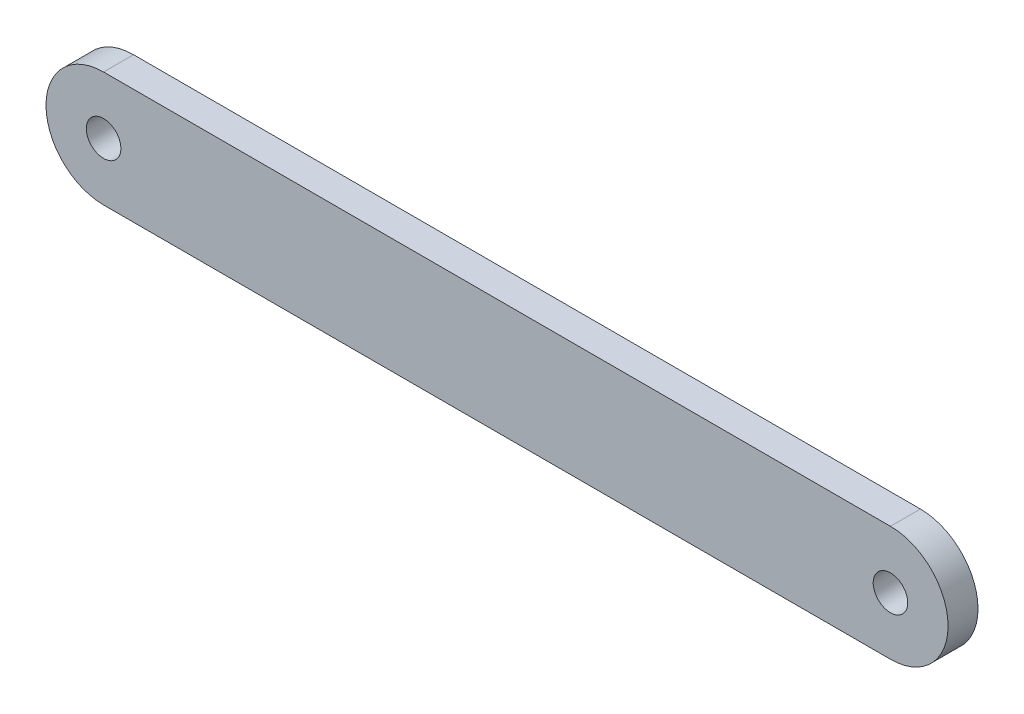
ISO-10303-21;
HEADER;
FILE_DESCRIPTION(('STEP AP214'),'2;1');
FILE_NAME('part.step','',(''),(''),'','','');
FILE_SCHEMA(('AUTOMOTIVE_DESIGN { 1 0 10303 214 1 1 1 1 }'));
ENDSEC;
DATA;
#1=APPLICATION_CONTEXT('core data for automotive mechanical design processes');
#2=APPLICATION_PROTOCOL_DEFINITION('international standard','automotive_design',2000,#1);
#3=PRODUCT_CONTEXT('',#1,'mechanical');
#4=PRODUCT('Part','Part','',(#3));
#5=PRODUCT_RELATED_PRODUCT_CATEGORY('part','',(#4));
#6=PRODUCT_DEFINITION_FORMATION('','',#4);
#7=PRODUCT_DEFINITION_CONTEXT('part definition',#1,'design');
#8=PRODUCT_DEFINITION('design','',#6,#7);
#9=PRODUCT_DEFINITION_SHAPE('','',#8);
#10=(LENGTH_UNIT() NAMED_UNIT(*) SI_UNIT(.MILLI.,.METRE.));
#11=(NAMED_UNIT(*) PLANE_ANGLE_UNIT() SI_UNIT($,.RADIAN.));
#12=(NAMED_UNIT(*) SI_UNIT($,.STERADIAN.) SOLID_ANGLE_UNIT());
#13=UNCERTAINTY_MEASURE_WITH_UNIT(LENGTH_MEASURE(1.E-05),#10,'distance_accuracy_value','');
#14=(GEOMETRIC_REPRESENTATION_CONTEXT(3) GLOBAL_UNCERTAINTY_ASSIGNED_CONTEXT((#13)) GLOBAL_UNIT_ASSIGNED_CONTEXT((#10,
#11,#12)) REPRESENTATION_CONTEXT('',''));
#15=CARTESIAN_POINT('',(0.,0.,0.));
#16=DIRECTION('',(0.,0.,1.));
#17=DIRECTION('',(1.,0.,0.));
#18=AXIS2_PLACEMENT_3D('',#15,#16,#17);
#19=CARTESIAN_POINT('',(-17.08,0.,0.65));
#20=DIRECTION('',(0.,0.,1.));
#21=DIRECTION('',(1.,0.,0.));
#22=AXIS2_PLACEMENT_3D('',#19,#20,#21);
#23=PLANE('',#22);
#24=CARTESIAN_POINT('',(-17.08,0.,0.65));
#25=DIRECTION('',(0.,0.,1.));
#26=DIRECTION('',(1.,0.,0.));
#27=AXIS2_PLACEMENT_3D('',#24,#25,#26);
#28=CIRCLE('',#27,0.750000000000002);
#29=CARTESIAN_POINT('',(-16.33,0.,0.65));
#30=VERTEX_POINT('',#29);
#31=EDGE_CURVE('E100',#30,#30,#28,.T.);
#32=ORIENTED_EDGE('',*,*,#31,.F.);
#33=EDGE_LOOP('',(#32));
#34=FACE_BOUND('',#33,.T.);
#35=CARTESIAN_POINT('',(-17.08,0.,0.65));
#36=DIRECTION('',(0.,0.,1.));
#37=DIRECTION('',(1.,0.,0.));
#38=AXIS2_PLACEMENT_3D('',#35,#36,#37);
#39=CIRCLE('',#38,2.50000000000001);
#40=CARTESIAN_POINT('',(-17.08,2.50000000000001,0.65));
#41=VERTEX_POINT('',#40);
#42=CARTESIAN_POINT('',(-17.08,-2.50000000000001,0.65));
#43=VERTEX_POINT('',#42);
#44=EDGE_CURVE('E85',#41,#43,#39,.T.);
#45=ORIENTED_EDGE('',*,*,#44,.T.);
#46=DIRECTION('',(1.,0.,0.));
#47=VECTOR('',#46,1.);
#48=CARTESIAN_POINT('',(-17.08,-2.50000000000001,0.65));
#49=LINE('',#48,#47);
#50=CARTESIAN_POINT('',(17.08,-2.5,0.65));
#51=VERTEX_POINT('',#50);
#52=EDGE_CURVE('E80',#43,#51,#49,.T.);
#53=ORIENTED_EDGE('',*,*,#52,.T.);
#54=CARTESIAN_POINT('',(17.08,0.,0.65));
#55=DIRECTION('',(0.,0.,1.));
#56=DIRECTION('',(1.,0.,0.));
#57=AXIS2_PLACEMENT_3D('',#54,#55,#56);
#58=CIRCLE('',#57,2.50000000000001);
#59=CARTESIAN_POINT('',(17.08,2.50000000000001,0.65));
#60=VERTEX_POINT('',#59);
#61=EDGE_CURVE('E83',#51,#60,#58,.T.);
#62=ORIENTED_EDGE('',*,*,#61,.T.);
#63=DIRECTION('',(-1.,0.,0.));
#64=VECTOR('',#63,1.);
#65=CARTESIAN_POINT('',(-17.08,2.50000000000001,0.65));
#66=LINE('',#65,#64);
#67=EDGE_CURVE('E50',#60,#41,#66,.T.);
#68=ORIENTED_EDGE('',*,*,#67,.T.);
#69=EDGE_LOOP('',(#45,#53,#62,#68));
#70=FACE_BOUND('',#69,.T.);
#71=CARTESIAN_POINT('',(17.08,0.,0.65));
#72=DIRECTION('',(0.,0.,1.));
#73=DIRECTION('',(1.,0.,0.));
#74=AXIS2_PLACEMENT_3D('',#71,#72,#73);
#75=CIRCLE('',#74,0.750000000000002);
#76=CARTESIAN_POINT('',(17.83,0.,0.65));
#77=VERTEX_POINT('',#76);
#78=EDGE_CURVE('E115',#77,#77,#75,.T.);
#79=ORIENTED_EDGE('',*,*,#78,.F.);
#80=EDGE_LOOP('',(#79));
#81=FACE_BOUND('',#80,.T.);
#82=ADVANCED_FACE('F33',(#34,#70,#81),#23,.T.);
#83=CARTESIAN_POINT('',(-17.08,0.,-0.65));
#84=DIRECTION('',(0.,0.,1.));
#85=DIRECTION('',(1.,0.,0.));
#86=AXIS2_PLACEMENT_3D('',#83,#84,#85);
#87=PLANE('',#86);
#88=CARTESIAN_POINT('',(-17.08,0.,-0.65));
#89=DIRECTION('',(0.,0.,1.));
#90=DIRECTION('',(1.,0.,0.));
#91=AXIS2_PLACEMENT_3D('',#88,#89,#90);
#92=CIRCLE('',#91,2.50000000000001);
#93=CARTESIAN_POINT('',(-17.08,2.50000000000001,-0.65));
#94=VERTEX_POINT('',#93);
#95=CARTESIAN_POINT('',(-17.08,-2.50000000000001,-0.65));
#96=VERTEX_POINT('',#95);
#97=EDGE_CURVE('E97',#94,#96,#92,.T.);
#98=ORIENTED_EDGE('',*,*,#97,.F.);
#99=DIRECTION('',(-1.,0.,0.));
#100=VECTOR('',#99,1.);
#101=CARTESIAN_POINT('',(-17.08,2.50000000000001,-0.65));
#102=LINE('',#101,#100);
#103=CARTESIAN_POINT('',(17.08,2.50000000000001,-0.65));
#104=VERTEX_POINT('',#103);
#105=EDGE_CURVE('E73',#104,#94,#102,.T.);
#106=ORIENTED_EDGE('',*,*,#105,.F.);
#107=CARTESIAN_POINT('',(17.08,0.,-0.65));
#108=DIRECTION('',(0.,0.,1.));
#109=DIRECTION('',(1.,0.,0.));
#110=AXIS2_PLACEMENT_3D('',#107,#108,#109);
#111=CIRCLE('',#110,2.50000000000001);
#112=CARTESIAN_POINT('',(17.08,-2.5,-0.65));
#113=VERTEX_POINT('',#112);
#114=EDGE_CURVE('E67',#113,#104,#111,.T.);
#115=ORIENTED_EDGE('',*,*,#114,.F.);
#116=DIRECTION('',(1.,0.,0.));
#117=VECTOR('',#116,1.);
#118=CARTESIAN_POINT('',(-17.08,-2.50000000000001,-0.65));
#119=LINE('',#118,#117);
#120=EDGE_CURVE('E89',#96,#113,#119,.T.);
#121=ORIENTED_EDGE('',*,*,#120,.F.);
#122=EDGE_LOOP('',(#98,#106,#115,#121));
#123=FACE_BOUND('',#122,.T.);
#124=CARTESIAN_POINT('',(-17.08,0.,-0.65));
#125=DIRECTION('',(0.,0.,1.));
#126=DIRECTION('',(1.,0.,0.));
#127=AXIS2_PLACEMENT_3D('',#124,#125,#126);
#128=CIRCLE('',#127,0.750000000000002);
#129=CARTESIAN_POINT('',(-16.33,0.,-0.65));
#130=VERTEX_POINT('',#129);
#131=EDGE_CURVE('E112',#130,#130,#128,.T.);
#132=ORIENTED_EDGE('',*,*,#131,.T.);
#133=EDGE_LOOP('',(#132));
#134=FACE_BOUND('',#133,.T.);
#135=CARTESIAN_POINT('',(17.08,0.,-0.65));
#136=DIRECTION('',(0.,0.,1.));
#137=DIRECTION('',(1.,0.,0.));
#138=AXIS2_PLACEMENT_3D('',#135,#136,#137);
#139=CIRCLE('',#138,0.750000000000002);
#140=CARTESIAN_POINT('',(17.83,0.,-0.65));
#141=VERTEX_POINT('',#140);
#142=EDGE_CURVE('E118',#141,#141,#139,.T.);
#143=ORIENTED_EDGE('',*,*,#142,.T.);
#144=EDGE_LOOP('',(#143));
#145=FACE_BOUND('',#144,.T.);
#146=ADVANCED_FACE('F108',(#123,#134,#145),#87,.F.);
#147=CARTESIAN_POINT('',(-17.08,0.,0.65));
#148=DIRECTION('',(0.,0.,-1.));
#149=DIRECTION('',(-1.,0.,0.));
#150=AXIS2_PLACEMENT_3D('',#147,#148,#149);
#151=CYLINDRICAL_SURFACE('',#150,2.50000000000001);
#152=ORIENTED_EDGE('',*,*,#97,.T.);
#153=DIRECTION('',(0.,0.,-1.));
#154=VECTOR('',#153,1.);
#155=CARTESIAN_POINT('',(-17.08,-2.50000000000001,0.65));
#156=LINE('',#155,#154);
#157=EDGE_CURVE('E11',#43,#96,#156,.T.);
#158=ORIENTED_EDGE('',*,*,#157,.F.);
#159=ORIENTED_EDGE('',*,*,#44,.F.);
#160=DIRECTION('',(0.,0.,-1.));
#161=VECTOR('',#160,1.);
#162=CARTESIAN_POINT('',(-17.08,2.50000000000001,0.65));
#163=LINE('',#162,#161);
#164=EDGE_CURVE('E93',#41,#94,#163,.T.);
#165=ORIENTED_EDGE('',*,*,#164,.T.);
#166=EDGE_LOOP('',(#152,#158,#159,#165));
#167=FACE_BOUND('',#166,.T.);
#168=ADVANCED_FACE('F35',(#167),#151,.T.);
#169=CARTESIAN_POINT('',(-17.08,-2.50000000000001,0.65));
#170=DIRECTION('',(0.,1.,0.));
#171=DIRECTION('',(-1.,0.,0.));
#172=AXIS2_PLACEMENT_3D('',#169,#170,#171);
#173=PLANE('',#172);
#174=ORIENTED_EDGE('',*,*,#120,.T.);
#175=DIRECTION('',(0.,0.,-1.));
#176=VECTOR('',#175,1.);
#177=CARTESIAN_POINT('',(17.08,-2.5,0.65));
#178=LINE('',#177,#176);
#179=EDGE_CURVE('E42',#51,#113,#178,.T.);
#180=ORIENTED_EDGE('',*,*,#179,.F.);
#181=ORIENTED_EDGE('',*,*,#52,.F.);
#182=ORIENTED_EDGE('',*,*,#157,.T.);
#183=EDGE_LOOP('',(#174,#180,#181,#182));
#184=FACE_BOUND('',#183,.T.);
#185=ADVANCED_FACE('F88',(#184),#173,.F.);
#186=CARTESIAN_POINT('',(17.08,0.,0.65));
#187=DIRECTION('',(0.,0.,-1.));
#188=DIRECTION('',(-1.,0.,0.));
#189=AXIS2_PLACEMENT_3D('',#186,#187,#188);
#190=CYLINDRICAL_SURFACE('',#189,2.50000000000001);
#191=ORIENTED_EDGE('',*,*,#114,.T.);
#192=DIRECTION('',(0.,0.,-1.));
#193=VECTOR('',#192,1.);
#194=CARTESIAN_POINT('',(17.08,2.50000000000001,0.65));
#195=LINE('',#194,#193);
#196=EDGE_CURVE('E90',#60,#104,#195,.T.);
#197=ORIENTED_EDGE('',*,*,#196,.F.);
#198=ORIENTED_EDGE('',*,*,#61,.F.);
#199=ORIENTED_EDGE('',*,*,#179,.T.);
#200=EDGE_LOOP('',(#191,#197,#198,#199));
#201=FACE_BOUND('',#200,.T.);
#202=ADVANCED_FACE('F91',(#201),#190,.T.);
#203=CARTESIAN_POINT('',(-17.08,2.50000000000001,0.65));
#204=DIRECTION('',(0.,-1.,0.));
#205=DIRECTION('',(1.,0.,0.));
#206=AXIS2_PLACEMENT_3D('',#203,#204,#205);
#207=PLANE('',#206);
#208=ORIENTED_EDGE('',*,*,#105,.T.);
#209=ORIENTED_EDGE('',*,*,#164,.F.);
#210=ORIENTED_EDGE('',*,*,#67,.F.);
#211=ORIENTED_EDGE('',*,*,#196,.T.);
#212=EDGE_LOOP('',(#208,#209,#210,#211));
#213=FACE_BOUND('',#212,.T.);
#214=ADVANCED_FACE('F105',(#213),#207,.F.);
#215=CARTESIAN_POINT('',(-17.08,0.,0.65));
#216=DIRECTION('',(0.,0.,-1.));
#217=DIRECTION('',(-1.,0.,0.));
#218=AXIS2_PLACEMENT_3D('',#215,#216,#217);
#219=CYLINDRICAL_SURFACE('',#218,0.750000000000002);
#220=ORIENTED_EDGE('',*,*,#31,.T.);
#221=EDGE_LOOP('',(#220));
#222=FACE_BOUND('',#221,.T.);
#223=ORIENTED_EDGE('',*,*,#131,.F.);
#224=EDGE_LOOP('',(#223));
#225=FACE_BOUND('',#224,.T.);
#226=ADVANCED_FACE('F135',(#222,#225),#219,.F.);
#227=CARTESIAN_POINT('',(17.08,0.,0.65));
#228=DIRECTION('',(0.,0.,-1.));
#229=DIRECTION('',(-1.,0.,0.));
#230=AXIS2_PLACEMENT_3D('',#227,#228,#229);
#231=CYLINDRICAL_SURFACE('',#230,0.750000000000002);
#232=ORIENTED_EDGE('',*,*,#78,.T.);
#233=EDGE_LOOP('',(#232));
#234=FACE_BOUND('',#233,.T.);
#235=ORIENTED_EDGE('',*,*,#142,.F.);
#236=EDGE_LOOP('',(#235));
#237=FACE_BOUND('',#236,.T.);
#238=ADVANCED_FACE('F124',(#234,#237),#231,.F.);
#239=CLOSED_SHELL('',(#82,#146,#168,#185,#202,#214,#226,#238));
#240=MANIFOLD_SOLID_BREP('B2',#239);
#241=ADVANCED_BREP_SHAPE_REPRESENTATION('',(#18,#240),#14);
#242=SHAPE_DEFINITION_REPRESENTATION(#9,#241);
ENDSEC;
END-ISO-10303-21;
